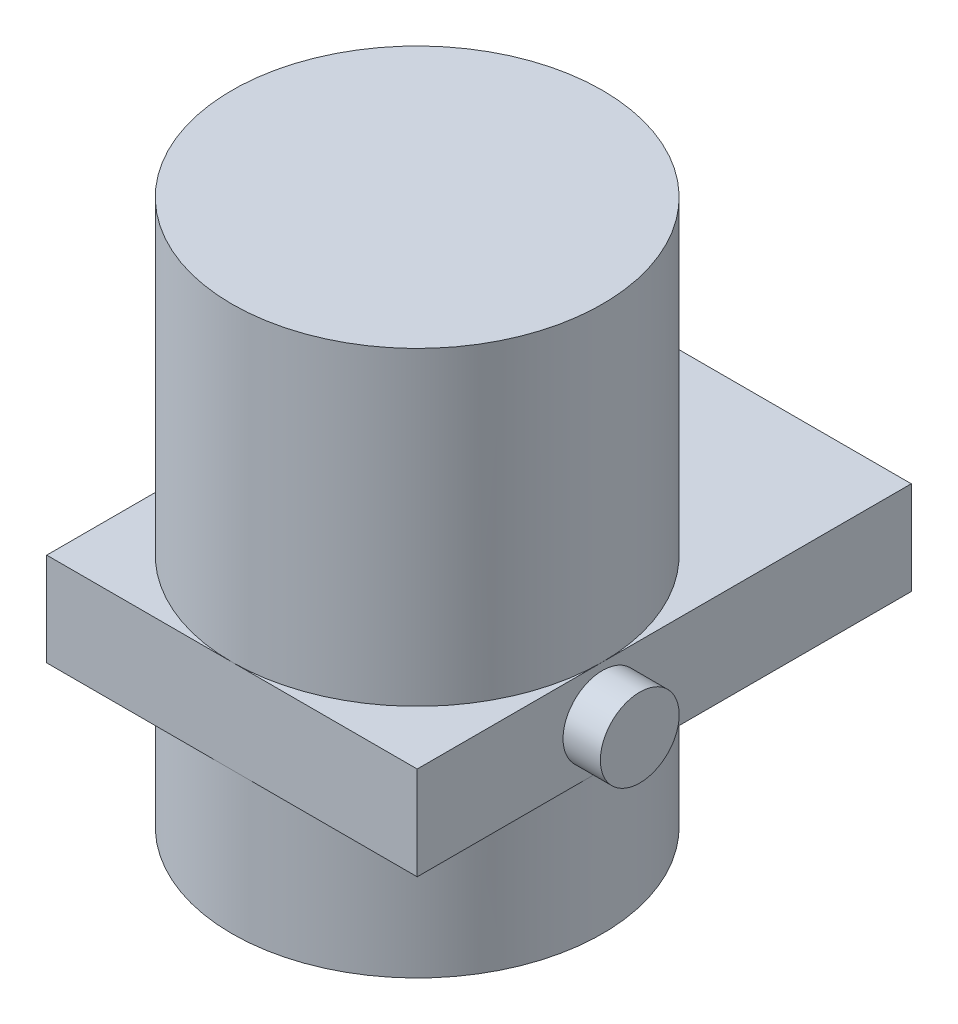
ISO-10303-21;
HEADER;
FILE_DESCRIPTION(('STEP AP214'),'2;1');
FILE_NAME('part.step','',(''),(''),'','','');
FILE_SCHEMA(('AUTOMOTIVE_DESIGN { 1 0 10303 214 1 1 1 1 }'));
ENDSEC;
DATA;
#1=APPLICATION_CONTEXT('core data for automotive mechanical design processes');
#2=APPLICATION_PROTOCOL_DEFINITION('international standard','automotive_design',2000,#1);
#3=PRODUCT_CONTEXT('',#1,'mechanical');
#4=PRODUCT('Part','Part','',(#3));
#5=PRODUCT_RELATED_PRODUCT_CATEGORY('part','',(#4));
#6=PRODUCT_DEFINITION_FORMATION('','',#4);
#7=PRODUCT_DEFINITION_CONTEXT('part definition',#1,'design');
#8=PRODUCT_DEFINITION('design','',#6,#7);
#9=PRODUCT_DEFINITION_SHAPE('','',#8);
#10=(LENGTH_UNIT() NAMED_UNIT(*) SI_UNIT(.MILLI.,.METRE.));
#11=(NAMED_UNIT(*) PLANE_ANGLE_UNIT() SI_UNIT($,.RADIAN.));
#12=(NAMED_UNIT(*) SI_UNIT($,.STERADIAN.) SOLID_ANGLE_UNIT());
#13=UNCERTAINTY_MEASURE_WITH_UNIT(LENGTH_MEASURE(1.E-05),#10,'distance_accuracy_value','');
#14=(GEOMETRIC_REPRESENTATION_CONTEXT(3) GLOBAL_UNCERTAINTY_ASSIGNED_CONTEXT((#13)) GLOBAL_UNIT_ASSIGNED_CONTEXT((#10,
#11,#12)) REPRESENTATION_CONTEXT('',''));
#15=CARTESIAN_POINT('',(0.,0.,0.));
#16=DIRECTION('',(0.,0.,1.));
#17=DIRECTION('',(1.,0.,0.));
#18=AXIS2_PLACEMENT_3D('',#15,#16,#17);
#19=CARTESIAN_POINT('',(125.984,63.5,125.984));
#20=DIRECTION('',(-1.,0.,0.));
#21=DIRECTION('',(0.,0.,1.));
#22=AXIS2_PLACEMENT_3D('',#19,#20,#21);
#23=PLANE('',#22);
#24=DIRECTION('',(0.,0.,-1.));
#25=VECTOR('',#24,1.);
#26=CARTESIAN_POINT('',(125.984,63.5,125.984));
#27=LINE('',#26,#25);
#28=CARTESIAN_POINT('',(125.984,63.5,0.));
#29=VERTEX_POINT('',#28);
#30=CARTESIAN_POINT('',(125.984,63.5,-210.058));
#31=VERTEX_POINT('',#30);
#32=EDGE_CURVE('E143',#29,#31,#27,.T.);
#33=ORIENTED_EDGE('',*,*,#32,.F.);
#34=CARTESIAN_POINT('',(125.984,63.5,125.984));
#35=VERTEX_POINT('',#34);
#36=EDGE_CURVE('E140',#35,#29,#27,.T.);
#37=ORIENTED_EDGE('',*,*,#36,.F.);
#38=DIRECTION('',(0.,-1.,0.));
#39=VECTOR('',#38,1.);
#40=CARTESIAN_POINT('',(125.984,63.5,125.984));
#41=LINE('',#40,#39);
#42=CARTESIAN_POINT('',(125.984,0.,125.984));
#43=VERTEX_POINT('',#42);
#44=EDGE_CURVE('E102',#35,#43,#41,.T.);
#45=ORIENTED_EDGE('',*,*,#44,.T.);
#46=DIRECTION('',(0.,0.,-1.));
#47=VECTOR('',#46,1.);
#48=CARTESIAN_POINT('',(125.984,0.,125.984));
#49=LINE('',#48,#47);
#50=CARTESIAN_POINT('',(125.984,0.,0.));
#51=VERTEX_POINT('',#50);
#52=EDGE_CURVE('E93',#43,#51,#49,.T.);
#53=ORIENTED_EDGE('',*,*,#52,.T.);
#54=CARTESIAN_POINT('',(125.984,0.,-210.058));
#55=VERTEX_POINT('',#54);
#56=EDGE_CURVE('E98',#51,#55,#49,.T.);
#57=ORIENTED_EDGE('',*,*,#56,.T.);
#58=DIRECTION('',(0.,-1.,0.));
#59=VECTOR('',#58,1.);
#60=CARTESIAN_POINT('',(125.984,63.5,-210.058));
#61=LINE('',#60,#59);
#62=EDGE_CURVE('E126',#31,#55,#61,.T.);
#63=ORIENTED_EDGE('',*,*,#62,.F.);
#64=EDGE_LOOP('',(#33,#37,#45,#53,#57,#63));
#65=FACE_BOUND('',#64,.T.);
#66=CARTESIAN_POINT('',(125.984,31.75,0.));
#67=DIRECTION('',(-1.,0.,0.));
#68=DIRECTION('',(0.,0.,1.));
#69=AXIS2_PLACEMENT_3D('',#66,#67,#68);
#70=CIRCLE('',#69,26.797);
#71=CARTESIAN_POINT('',(125.984,31.75,26.797));
#72=VERTEX_POINT('',#71);
#73=EDGE_CURVE('E11',#72,#72,#70,.F.);
#74=ORIENTED_EDGE('',*,*,#73,.F.);
#75=EDGE_LOOP('',(#74));
#76=FACE_BOUND('',#75,.T.);
#77=ADVANCED_FACE('F32',(#65,#76),#23,.F.);
#78=CARTESIAN_POINT('',(-125.984,63.5,-210.058));
#79=DIRECTION('',(0.,-1.,0.));
#80=DIRECTION('',(0.,0.,-1.));
#81=AXIS2_PLACEMENT_3D('',#78,#79,#80);
#82=PLANE('',#81);
#83=ORIENTED_EDGE('',*,*,#36,.T.);
#84=CARTESIAN_POINT('',(0.,63.5,0.));
#85=DIRECTION('',(0.,-1.,0.));
#86=DIRECTION('',(0.,0.,-1.));
#87=AXIS2_PLACEMENT_3D('',#84,#85,#86);
#88=CIRCLE('',#87,125.984);
#89=CARTESIAN_POINT('',(0.,63.5,125.984));
#90=VERTEX_POINT('',#89);
#91=EDGE_CURVE('E47',#29,#90,#88,.T.);
#92=ORIENTED_EDGE('',*,*,#91,.T.);
#93=DIRECTION('',(1.,0.,0.));
#94=VECTOR('',#93,1.);
#95=CARTESIAN_POINT('',(-125.984,63.5,125.984));
#96=LINE('',#95,#94);
#97=EDGE_CURVE('E147',#90,#35,#96,.T.);
#98=ORIENTED_EDGE('',*,*,#97,.T.);
#99=EDGE_LOOP('',(#83,#92,#98));
#100=FACE_BOUND('',#99,.T.);
#101=ADVANCED_FACE('F173',(#100),#82,.F.);
#102=CARTESIAN_POINT('',(-125.984,63.5,125.984));
#103=VERTEX_POINT('',#102);
#104=EDGE_CURVE('E144',#103,#90,#96,.T.);
#105=ORIENTED_EDGE('',*,*,#104,.T.);
#106=CARTESIAN_POINT('',(-125.984,63.5,0.));
#107=VERTEX_POINT('',#106);
#108=EDGE_CURVE('E153',#90,#107,#88,.T.);
#109=ORIENTED_EDGE('',*,*,#108,.T.);
#110=DIRECTION('',(0.,0.,1.));
#111=VECTOR('',#110,1.);
#112=CARTESIAN_POINT('',(-125.984,63.5,125.984));
#113=LINE('',#112,#111);
#114=EDGE_CURVE('E132',#107,#103,#113,.T.);
#115=ORIENTED_EDGE('',*,*,#114,.T.);
#116=EDGE_LOOP('',(#105,#109,#115));
#117=FACE_BOUND('',#116,.T.);
#118=ADVANCED_FACE('F178',(#117),#82,.F.);
#119=CARTESIAN_POINT('',(-125.984,0.,-210.058));
#120=DIRECTION('',(0.,-1.,0.));
#121=DIRECTION('',(0.,0.,-1.));
#122=AXIS2_PLACEMENT_3D('',#119,#120,#121);
#123=PLANE('',#122);
#124=CARTESIAN_POINT('',(0.,0.,0.));
#125=DIRECTION('',(0.,-1.,0.));
#126=DIRECTION('',(0.,0.,-1.));
#127=AXIS2_PLACEMENT_3D('',#124,#125,#126);
#128=CIRCLE('',#127,125.984);
#129=CARTESIAN_POINT('',(0.,0.,125.984));
#130=VERTEX_POINT('',#129);
#131=EDGE_CURVE('E40',#51,#130,#128,.T.);
#132=ORIENTED_EDGE('',*,*,#131,.F.);
#133=ORIENTED_EDGE('',*,*,#52,.F.);
#134=DIRECTION('',(1.,0.,0.));
#135=VECTOR('',#134,1.);
#136=CARTESIAN_POINT('',(-125.984,0.,125.984));
#137=LINE('',#136,#135);
#138=EDGE_CURVE('E116',#130,#43,#137,.T.);
#139=ORIENTED_EDGE('',*,*,#138,.F.);
#140=EDGE_LOOP('',(#132,#133,#139));
#141=FACE_BOUND('',#140,.T.);
#142=ADVANCED_FACE('F115',(#141),#123,.T.);
#143=CARTESIAN_POINT('',(-125.984,0.,0.));
#144=VERTEX_POINT('',#143);
#145=EDGE_CURVE('E55',#130,#144,#128,.T.);
#146=ORIENTED_EDGE('',*,*,#145,.F.);
#147=CARTESIAN_POINT('',(-125.984,0.,125.984));
#148=VERTEX_POINT('',#147);
#149=EDGE_CURVE('E113',#148,#130,#137,.T.);
#150=ORIENTED_EDGE('',*,*,#149,.F.);
#151=DIRECTION('',(0.,0.,1.));
#152=VECTOR('',#151,1.);
#153=CARTESIAN_POINT('',(-125.984,0.,125.984));
#154=LINE('',#153,#152);
#155=EDGE_CURVE('E138',#144,#148,#154,.T.);
#156=ORIENTED_EDGE('',*,*,#155,.F.);
#157=EDGE_LOOP('',(#146,#150,#156));
#158=FACE_BOUND('',#157,.T.);
#159=ADVANCED_FACE('F193',(#158),#123,.T.);
#160=CARTESIAN_POINT('',(-125.984,63.5,125.984));
#161=DIRECTION('',(1.,0.,0.));
#162=DIRECTION('',(0.,0.,-1.));
#163=AXIS2_PLACEMENT_3D('',#160,#161,#162);
#164=PLANE('',#163);
#165=ORIENTED_EDGE('',*,*,#114,.F.);
#166=CARTESIAN_POINT('',(-125.984,63.5,-210.058));
#167=VERTEX_POINT('',#166);
#168=EDGE_CURVE('E148',#167,#107,#113,.T.);
#169=ORIENTED_EDGE('',*,*,#168,.F.);
#170=DIRECTION('',(0.,-1.,0.));
#171=VECTOR('',#170,1.);
#172=CARTESIAN_POINT('',(-125.984,63.5,-210.058));
#173=LINE('',#172,#171);
#174=CARTESIAN_POINT('',(-125.984,0.,-210.058));
#175=VERTEX_POINT('',#174);
#176=EDGE_CURVE('E128',#167,#175,#173,.T.);
#177=ORIENTED_EDGE('',*,*,#176,.T.);
#178=EDGE_CURVE('E135',#175,#144,#154,.T.);
#179=ORIENTED_EDGE('',*,*,#178,.T.);
#180=ORIENTED_EDGE('',*,*,#155,.T.);
#181=DIRECTION('',(0.,-1.,0.));
#182=VECTOR('',#181,1.);
#183=CARTESIAN_POINT('',(-125.984,63.5,125.984));
#184=LINE('',#183,#182);
#185=EDGE_CURVE('E121',#103,#148,#184,.T.);
#186=ORIENTED_EDGE('',*,*,#185,.F.);
#187=EDGE_LOOP('',(#165,#169,#177,#179,#180,#186));
#188=FACE_BOUND('',#187,.T.);
#189=ADVANCED_FACE('F34',(#188),#164,.F.);
#190=CARTESIAN_POINT('',(-125.984,63.5,125.984));
#191=DIRECTION('',(0.,0.,-1.));
#192=DIRECTION('',(-1.,0.,0.));
#193=AXIS2_PLACEMENT_3D('',#190,#191,#192);
#194=PLANE('',#193);
#195=ORIENTED_EDGE('',*,*,#97,.F.);
#196=ORIENTED_EDGE('',*,*,#104,.F.);
#197=ORIENTED_EDGE('',*,*,#185,.T.);
#198=ORIENTED_EDGE('',*,*,#149,.T.);
#199=ORIENTED_EDGE('',*,*,#138,.T.);
#200=ORIENTED_EDGE('',*,*,#44,.F.);
#201=EDGE_LOOP('',(#195,#196,#197,#198,#199,#200));
#202=FACE_BOUND('',#201,.T.);
#203=ADVANCED_FACE('F185',(#202),#194,.F.);
#204=CARTESIAN_POINT('',(-125.984,63.5,-210.058));
#205=DIRECTION('',(0.,0.,1.));
#206=DIRECTION('',(1.,0.,0.));
#207=AXIS2_PLACEMENT_3D('',#204,#205,#206);
#208=PLANE('',#207);
#209=DIRECTION('',(-1.,0.,0.));
#210=VECTOR('',#209,1.);
#211=CARTESIAN_POINT('',(-125.984,0.,-210.058));
#212=LINE('',#211,#210);
#213=EDGE_CURVE('E105',#55,#175,#212,.T.);
#214=ORIENTED_EDGE('',*,*,#213,.T.);
#215=ORIENTED_EDGE('',*,*,#176,.F.);
#216=DIRECTION('',(-1.,0.,0.));
#217=VECTOR('',#216,1.);
#218=CARTESIAN_POINT('',(-125.984,63.5,-210.058));
#219=LINE('',#218,#217);
#220=EDGE_CURVE('E131',#31,#167,#219,.T.);
#221=ORIENTED_EDGE('',*,*,#220,.F.);
#222=ORIENTED_EDGE('',*,*,#62,.T.);
#223=EDGE_LOOP('',(#214,#215,#221,#222));
#224=FACE_BOUND('',#223,.T.);
#225=ADVANCED_FACE('F183',(#224),#208,.F.);
#226=ORIENTED_EDGE('',*,*,#168,.T.);
#227=EDGE_CURVE('E151',#107,#29,#88,.T.);
#228=ORIENTED_EDGE('',*,*,#227,.T.);
#229=ORIENTED_EDGE('',*,*,#32,.T.);
#230=ORIENTED_EDGE('',*,*,#220,.T.);
#231=EDGE_LOOP('',(#226,#228,#229,#230));
#232=FACE_BOUND('',#231,.T.);
#233=ADVANCED_FACE('F181',(#232),#82,.F.);
#234=EDGE_CURVE('E112',#144,#51,#128,.T.);
#235=ORIENTED_EDGE('',*,*,#234,.F.);
#236=ORIENTED_EDGE('',*,*,#178,.F.);
#237=ORIENTED_EDGE('',*,*,#213,.F.);
#238=ORIENTED_EDGE('',*,*,#56,.F.);
#239=EDGE_LOOP('',(#235,#236,#237,#238));
#240=FACE_BOUND('',#239,.T.);
#241=ADVANCED_FACE('F109',(#240),#123,.T.);
#242=CARTESIAN_POINT('',(0.,-96.52,0.));
#243=DIRECTION('',(0.,-1.,0.));
#244=DIRECTION('',(0.,0.,-1.));
#245=AXIS2_PLACEMENT_3D('',#242,#243,#244);
#246=PLANE('',#245);
#247=CARTESIAN_POINT('',(0.,-96.52,0.));
#248=DIRECTION('',(0.,-1.,0.));
#249=DIRECTION('',(0.,0.,-1.));
#250=AXIS2_PLACEMENT_3D('',#247,#248,#249);
#251=CIRCLE('',#250,125.984);
#252=CARTESIAN_POINT('',(0.,-96.52,-125.984));
#253=VERTEX_POINT('',#252);
#254=EDGE_CURVE('E157',#253,#253,#251,.T.);
#255=ORIENTED_EDGE('',*,*,#254,.T.);
#256=EDGE_LOOP('',(#255));
#257=FACE_BOUND('',#256,.T.);
#258=ADVANCED_FACE('F210',(#257),#246,.T.);
#259=CARTESIAN_POINT('',(0.,274.32,0.));
#260=DIRECTION('',(0.,-1.,0.));
#261=DIRECTION('',(0.,0.,-1.));
#262=AXIS2_PLACEMENT_3D('',#259,#260,#261);
#263=CYLINDRICAL_SURFACE('',#262,125.984);
#264=ORIENTED_EDGE('',*,*,#234,.T.);
#265=ORIENTED_EDGE('',*,*,#131,.T.);
#266=ORIENTED_EDGE('',*,*,#145,.T.);
#267=EDGE_LOOP('',(#264,#265,#266));
#268=FACE_BOUND('',#267,.T.);
#269=ORIENTED_EDGE('',*,*,#254,.F.);
#270=EDGE_LOOP('',(#269));
#271=FACE_BOUND('',#270,.T.);
#272=ADVANCED_FACE('F119',(#268,#271),#263,.T.);
#273=CARTESIAN_POINT('',(0.,274.32,0.));
#274=DIRECTION('',(0.,-1.,0.));
#275=DIRECTION('',(0.,0.,-1.));
#276=AXIS2_PLACEMENT_3D('',#273,#274,#275);
#277=CIRCLE('',#276,125.984);
#278=CARTESIAN_POINT('',(0.,274.32,-125.984));
#279=VERTEX_POINT('',#278);
#280=EDGE_CURVE('E154',#279,#279,#277,.T.);
#281=ORIENTED_EDGE('',*,*,#280,.T.);
#282=EDGE_LOOP('',(#281));
#283=FACE_BOUND('',#282,.T.);
#284=ORIENTED_EDGE('',*,*,#91,.F.);
#285=ORIENTED_EDGE('',*,*,#227,.F.);
#286=ORIENTED_EDGE('',*,*,#108,.F.);
#287=EDGE_LOOP('',(#284,#285,#286));
#288=FACE_BOUND('',#287,.T.);
#289=ADVANCED_FACE('F268',(#283,#288),#263,.T.);
#290=CARTESIAN_POINT('',(0.,274.32,0.));
#291=DIRECTION('',(0.,-1.,0.));
#292=DIRECTION('',(0.,0.,-1.));
#293=AXIS2_PLACEMENT_3D('',#290,#291,#292);
#294=PLANE('',#293);
#295=ORIENTED_EDGE('',*,*,#280,.F.);
#296=EDGE_LOOP('',(#295));
#297=FACE_BOUND('',#296,.T.);
#298=ADVANCED_FACE('F169',(#297),#294,.F.);
#299=CARTESIAN_POINT('',(151.384,31.75,0.));
#300=DIRECTION('',(-1.,0.,0.));
#301=DIRECTION('',(0.,0.,1.));
#302=AXIS2_PLACEMENT_3D('',#299,#300,#301);
#303=CYLINDRICAL_SURFACE('',#302,26.797);
#304=CARTESIAN_POINT('',(151.384,31.75,0.));
#305=DIRECTION('',(1.,0.,0.));
#306=DIRECTION('',(0.,0.,-1.));
#307=AXIS2_PLACEMENT_3D('',#304,#305,#306);
#308=CIRCLE('',#307,26.797);
#309=CARTESIAN_POINT('',(151.384,31.75,-26.797));
#310=VERTEX_POINT('',#309);
#311=EDGE_CURVE('E160',#310,#310,#308,.T.);
#312=ORIENTED_EDGE('',*,*,#311,.F.);
#313=EDGE_LOOP('',(#312));
#314=FACE_BOUND('',#313,.T.);
#315=ORIENTED_EDGE('',*,*,#73,.T.);
#316=EDGE_LOOP('',(#315));
#317=FACE_BOUND('',#316,.T.);
#318=ADVANCED_FACE('F166',(#314,#317),#303,.T.);
#319=CARTESIAN_POINT('',(151.384,31.75,0.));
#320=DIRECTION('',(1.,0.,0.));
#321=DIRECTION('',(0.,0.,-1.));
#322=AXIS2_PLACEMENT_3D('',#319,#320,#321);
#323=PLANE('',#322);
#324=ORIENTED_EDGE('',*,*,#311,.T.);
#325=EDGE_LOOP('',(#324));
#326=FACE_BOUND('',#325,.T.);
#327=ADVANCED_FACE('F164',(#326),#323,.T.);
#328=CLOSED_SHELL('',(#77,#101,#118,#142,#159,#189,#203,#225,#233,#241,#258,#272,#289,#298,#318,#327));
#329=MANIFOLD_SOLID_BREP('B2',#328);
#330=ADVANCED_BREP_SHAPE_REPRESENTATION('',(#18,#329),#14);
#331=SHAPE_DEFINITION_REPRESENTATION(#9,#330);
ENDSEC;
END-ISO-10303-21;
